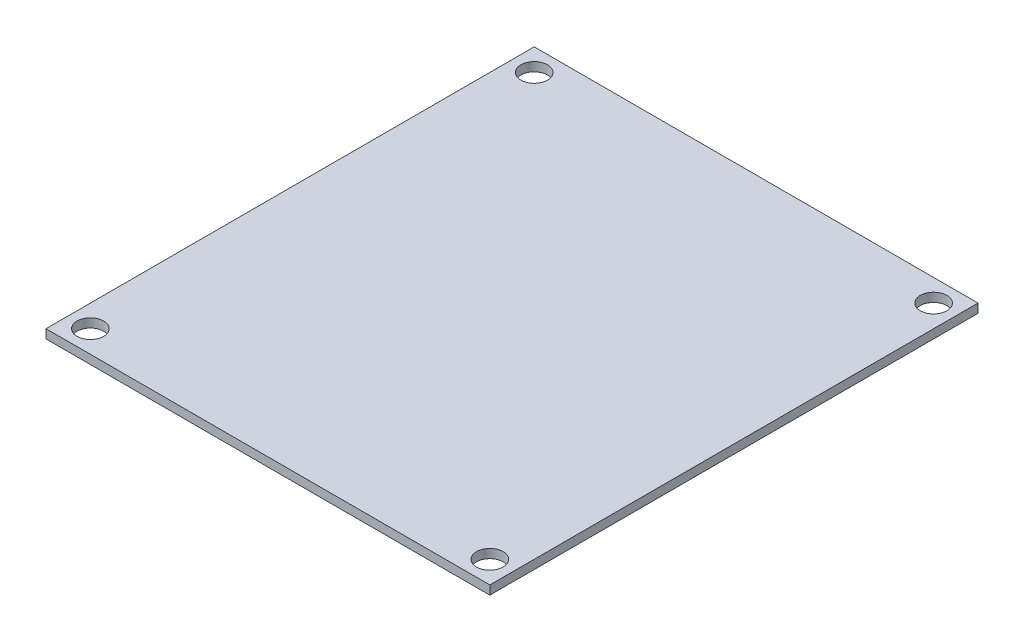
ISO-10303-21;
HEADER;
FILE_DESCRIPTION(('STEP AP214'),'2;1');
FILE_NAME('part.step','',(''),(''),'','','');
FILE_SCHEMA(('AUTOMOTIVE_DESIGN { 1 0 10303 214 1 1 1 1 }'));
ENDSEC;
DATA;
#1=APPLICATION_CONTEXT('core data for automotive mechanical design processes');
#2=APPLICATION_PROTOCOL_DEFINITION('international standard','automotive_design',2000,#1);
#3=PRODUCT_CONTEXT('',#1,'mechanical');
#4=PRODUCT('Part','Part','',(#3));
#5=PRODUCT_RELATED_PRODUCT_CATEGORY('part','',(#4));
#6=PRODUCT_DEFINITION_FORMATION('','',#4);
#7=PRODUCT_DEFINITION_CONTEXT('part definition',#1,'design');
#8=PRODUCT_DEFINITION('design','',#6,#7);
#9=PRODUCT_DEFINITION_SHAPE('','',#8);
#10=(LENGTH_UNIT() NAMED_UNIT(*) SI_UNIT(.MILLI.,.METRE.));
#11=(NAMED_UNIT(*) PLANE_ANGLE_UNIT() SI_UNIT($,.RADIAN.));
#12=(NAMED_UNIT(*) SI_UNIT($,.STERADIAN.) SOLID_ANGLE_UNIT());
#13=UNCERTAINTY_MEASURE_WITH_UNIT(LENGTH_MEASURE(1.E-05),#10,'distance_accuracy_value','');
#14=(GEOMETRIC_REPRESENTATION_CONTEXT(3) GLOBAL_UNCERTAINTY_ASSIGNED_CONTEXT((#13)) GLOBAL_UNIT_ASSIGNED_CONTEXT((#10,
#11,#12)) REPRESENTATION_CONTEXT('',''));
#15=CARTESIAN_POINT('',(0.,0.,0.));
#16=DIRECTION('',(0.,0.,1.));
#17=DIRECTION('',(1.,0.,0.));
#18=AXIS2_PLACEMENT_3D('',#15,#16,#17);
#19=CARTESIAN_POINT('',(0.,1.,0.));
#20=DIRECTION('',(1.,0.,0.));
#21=DIRECTION('',(0.,0.,-1.));
#22=AXIS2_PLACEMENT_3D('',#19,#20,#21);
#23=PLANE('',#22);
#24=DIRECTION('',(0.,0.,1.));
#25=VECTOR('',#24,1.);
#26=CARTESIAN_POINT('',(0.,0.,0.));
#27=LINE('',#26,#25);
#28=CARTESIAN_POINT('',(0.,0.,0.));
#29=VERTEX_POINT('',#28);
#30=CARTESIAN_POINT('',(0.,0.,55.));
#31=VERTEX_POINT('',#30);
#32=EDGE_CURVE('E101',#29,#31,#27,.T.);
#33=ORIENTED_EDGE('',*,*,#32,.T.);
#34=DIRECTION('',(0.,-1.,0.));
#35=VECTOR('',#34,1.);
#36=CARTESIAN_POINT('',(0.,1.,55.));
#37=LINE('',#36,#35);
#38=CARTESIAN_POINT('',(0.,1.,55.));
#39=VERTEX_POINT('',#38);
#40=EDGE_CURVE('E11',#39,#31,#37,.T.);
#41=ORIENTED_EDGE('',*,*,#40,.F.);
#42=DIRECTION('',(0.,0.,1.));
#43=VECTOR('',#42,1.);
#44=CARTESIAN_POINT('',(0.,1.,0.));
#45=LINE('',#44,#43);
#46=CARTESIAN_POINT('',(0.,1.,0.));
#47=VERTEX_POINT('',#46);
#48=EDGE_CURVE('E89',#47,#39,#45,.T.);
#49=ORIENTED_EDGE('',*,*,#48,.F.);
#50=DIRECTION('',(0.,-1.,0.));
#51=VECTOR('',#50,1.);
#52=CARTESIAN_POINT('',(0.,1.,0.));
#53=LINE('',#52,#51);
#54=EDGE_CURVE('E97',#47,#29,#53,.T.);
#55=ORIENTED_EDGE('',*,*,#54,.T.);
#56=EDGE_LOOP('',(#33,#41,#49,#55));
#57=FACE_BOUND('',#56,.T.);
#58=ADVANCED_FACE('F38',(#57),#23,.F.);
#59=CARTESIAN_POINT('',(0.,1.,55.));
#60=DIRECTION('',(0.,0.,-1.));
#61=DIRECTION('',(-1.,0.,0.));
#62=AXIS2_PLACEMENT_3D('',#59,#60,#61);
#63=PLANE('',#62);
#64=DIRECTION('',(1.,0.,0.));
#65=VECTOR('',#64,1.);
#66=CARTESIAN_POINT('',(0.,0.,55.));
#67=LINE('',#66,#65);
#68=CARTESIAN_POINT('',(50.,0.,55.));
#69=VERTEX_POINT('',#68);
#70=EDGE_CURVE('E93',#31,#69,#67,.T.);
#71=ORIENTED_EDGE('',*,*,#70,.T.);
#72=DIRECTION('',(0.,-1.,0.));
#73=VECTOR('',#72,1.);
#74=CARTESIAN_POINT('',(50.,1.,55.));
#75=LINE('',#74,#73);
#76=CARTESIAN_POINT('',(50.,1.,55.));
#77=VERTEX_POINT('',#76);
#78=EDGE_CURVE('E46',#77,#69,#75,.T.);
#79=ORIENTED_EDGE('',*,*,#78,.F.);
#80=DIRECTION('',(1.,0.,0.));
#81=VECTOR('',#80,1.);
#82=CARTESIAN_POINT('',(0.,1.,55.));
#83=LINE('',#82,#81);
#84=EDGE_CURVE('E84',#39,#77,#83,.T.);
#85=ORIENTED_EDGE('',*,*,#84,.F.);
#86=ORIENTED_EDGE('',*,*,#40,.T.);
#87=EDGE_LOOP('',(#71,#79,#85,#86));
#88=FACE_BOUND('',#87,.T.);
#89=ADVANCED_FACE('F92',(#88),#63,.F.);
#90=CARTESIAN_POINT('',(50.,1.,0.));
#91=DIRECTION('',(-1.,0.,0.));
#92=DIRECTION('',(0.,0.,1.));
#93=AXIS2_PLACEMENT_3D('',#90,#91,#92);
#94=PLANE('',#93);
#95=DIRECTION('',(0.,0.,-1.));
#96=VECTOR('',#95,1.);
#97=CARTESIAN_POINT('',(50.,0.,0.));
#98=LINE('',#97,#96);
#99=CARTESIAN_POINT('',(50.,0.,0.));
#100=VERTEX_POINT('',#99);
#101=EDGE_CURVE('E71',#69,#100,#98,.T.);
#102=ORIENTED_EDGE('',*,*,#101,.T.);
#103=DIRECTION('',(0.,-1.,0.));
#104=VECTOR('',#103,1.);
#105=CARTESIAN_POINT('',(50.,1.,0.));
#106=LINE('',#105,#104);
#107=CARTESIAN_POINT('',(50.,1.,0.));
#108=VERTEX_POINT('',#107);
#109=EDGE_CURVE('E94',#108,#100,#106,.T.);
#110=ORIENTED_EDGE('',*,*,#109,.F.);
#111=DIRECTION('',(0.,0.,-1.));
#112=VECTOR('',#111,1.);
#113=CARTESIAN_POINT('',(50.,1.,0.));
#114=LINE('',#113,#112);
#115=EDGE_CURVE('E87',#77,#108,#114,.T.);
#116=ORIENTED_EDGE('',*,*,#115,.F.);
#117=ORIENTED_EDGE('',*,*,#78,.T.);
#118=EDGE_LOOP('',(#102,#110,#116,#117));
#119=FACE_BOUND('',#118,.T.);
#120=ADVANCED_FACE('F95',(#119),#94,.F.);
#121=CARTESIAN_POINT('',(0.,1.,0.));
#122=DIRECTION('',(0.,0.,1.));
#123=DIRECTION('',(1.,0.,0.));
#124=AXIS2_PLACEMENT_3D('',#121,#122,#123);
#125=PLANE('',#124);
#126=DIRECTION('',(-1.,0.,0.));
#127=VECTOR('',#126,1.);
#128=CARTESIAN_POINT('',(0.,0.,0.));
#129=LINE('',#128,#127);
#130=EDGE_CURVE('E77',#100,#29,#129,.T.);
#131=ORIENTED_EDGE('',*,*,#130,.T.);
#132=ORIENTED_EDGE('',*,*,#54,.F.);
#133=DIRECTION('',(-1.,0.,0.));
#134=VECTOR('',#133,1.);
#135=CARTESIAN_POINT('',(0.,1.,0.));
#136=LINE('',#135,#134);
#137=EDGE_CURVE('E54',#108,#47,#136,.T.);
#138=ORIENTED_EDGE('',*,*,#137,.F.);
#139=ORIENTED_EDGE('',*,*,#109,.T.);
#140=EDGE_LOOP('',(#131,#132,#138,#139));
#141=FACE_BOUND('',#140,.T.);
#142=ADVANCED_FACE('F109',(#141),#125,.F.);
#143=CARTESIAN_POINT('',(0.,1.,0.));
#144=DIRECTION('',(0.,1.,0.));
#145=DIRECTION('',(0.,0.,1.));
#146=AXIS2_PLACEMENT_3D('',#143,#144,#145);
#147=PLANE('',#146);
#148=CARTESIAN_POINT('',(2.5,1.,52.5));
#149=DIRECTION('',(0.,1.,0.));
#150=DIRECTION('',(0.,0.,-1.));
#151=AXIS2_PLACEMENT_3D('',#148,#149,#150);
#152=CIRCLE('',#151,1.5);
#153=CARTESIAN_POINT('',(2.5,1.,51.));
#154=VERTEX_POINT('',#153);
#155=EDGE_CURVE('E133',#154,#154,#152,.T.);
#156=ORIENTED_EDGE('',*,*,#155,.F.);
#157=EDGE_LOOP('',(#156));
#158=FACE_BOUND('',#157,.T.);
#159=CARTESIAN_POINT('',(47.5,1.,52.5));
#160=DIRECTION('',(0.,1.,0.));
#161=DIRECTION('',(0.,0.,1.));
#162=AXIS2_PLACEMENT_3D('',#159,#160,#161);
#163=CIRCLE('',#162,1.5);
#164=CARTESIAN_POINT('',(47.5,1.,54.));
#165=VERTEX_POINT('',#164);
#166=EDGE_CURVE('E127',#165,#165,#163,.T.);
#167=ORIENTED_EDGE('',*,*,#166,.F.);
#168=EDGE_LOOP('',(#167));
#169=FACE_BOUND('',#168,.T.);
#170=CARTESIAN_POINT('',(47.5,1.,2.49999999999999));
#171=DIRECTION('',(0.,1.,0.));
#172=DIRECTION('',(0.,0.,-1.));
#173=AXIS2_PLACEMENT_3D('',#170,#171,#172);
#174=CIRCLE('',#173,1.5);
#175=CARTESIAN_POINT('',(47.5,1.,0.99999999999999));
#176=VERTEX_POINT('',#175);
#177=EDGE_CURVE('E121',#176,#176,#174,.T.);
#178=ORIENTED_EDGE('',*,*,#177,.F.);
#179=EDGE_LOOP('',(#178));
#180=FACE_BOUND('',#179,.T.);
#181=CARTESIAN_POINT('',(2.5,1.,2.5));
#182=DIRECTION('',(0.,1.,0.));
#183=DIRECTION('',(0.,0.,1.));
#184=AXIS2_PLACEMENT_3D('',#181,#182,#183);
#185=CIRCLE('',#184,1.5);
#186=CARTESIAN_POINT('',(2.5,1.,4.));
#187=VERTEX_POINT('',#186);
#188=EDGE_CURVE('E115',#187,#187,#185,.T.);
#189=ORIENTED_EDGE('',*,*,#188,.F.);
#190=EDGE_LOOP('',(#189));
#191=FACE_BOUND('',#190,.T.);
#192=ORIENTED_EDGE('',*,*,#48,.T.);
#193=ORIENTED_EDGE('',*,*,#84,.T.);
#194=ORIENTED_EDGE('',*,*,#115,.T.);
#195=ORIENTED_EDGE('',*,*,#137,.T.);
#196=EDGE_LOOP('',(#192,#193,#194,#195));
#197=FACE_BOUND('',#196,.T.);
#198=ADVANCED_FACE('F85',(#158,#169,#180,#191,#197),#147,.T.);
#199=CARTESIAN_POINT('',(0.,0.,0.));
#200=DIRECTION('',(0.,1.,0.));
#201=DIRECTION('',(0.,0.,1.));
#202=AXIS2_PLACEMENT_3D('',#199,#200,#201);
#203=PLANE('',#202);
#204=CARTESIAN_POINT('',(2.5,0.,52.5));
#205=DIRECTION('',(0.,1.,0.));
#206=DIRECTION('',(0.,0.,-1.));
#207=AXIS2_PLACEMENT_3D('',#204,#205,#206);
#208=CIRCLE('',#207,1.5);
#209=CARTESIAN_POINT('',(2.5,0.,51.));
#210=VERTEX_POINT('',#209);
#211=EDGE_CURVE('E130',#210,#210,#208,.T.);
#212=ORIENTED_EDGE('',*,*,#211,.T.);
#213=EDGE_LOOP('',(#212));
#214=FACE_BOUND('',#213,.T.);
#215=CARTESIAN_POINT('',(47.5,0.,52.5));
#216=DIRECTION('',(0.,1.,0.));
#217=DIRECTION('',(0.,0.,1.));
#218=AXIS2_PLACEMENT_3D('',#215,#216,#217);
#219=CIRCLE('',#218,1.5);
#220=CARTESIAN_POINT('',(47.5,0.,54.));
#221=VERTEX_POINT('',#220);
#222=EDGE_CURVE('E124',#221,#221,#219,.T.);
#223=ORIENTED_EDGE('',*,*,#222,.T.);
#224=EDGE_LOOP('',(#223));
#225=FACE_BOUND('',#224,.T.);
#226=CARTESIAN_POINT('',(47.5,0.,2.49999999999999));
#227=DIRECTION('',(0.,1.,0.));
#228=DIRECTION('',(0.,0.,-1.));
#229=AXIS2_PLACEMENT_3D('',#226,#227,#228);
#230=CIRCLE('',#229,1.5);
#231=CARTESIAN_POINT('',(47.5,0.,0.99999999999999));
#232=VERTEX_POINT('',#231);
#233=EDGE_CURVE('E118',#232,#232,#230,.T.);
#234=ORIENTED_EDGE('',*,*,#233,.T.);
#235=EDGE_LOOP('',(#234));
#236=FACE_BOUND('',#235,.T.);
#237=CARTESIAN_POINT('',(2.5,0.,2.5));
#238=DIRECTION('',(0.,1.,0.));
#239=DIRECTION('',(0.,0.,1.));
#240=AXIS2_PLACEMENT_3D('',#237,#238,#239);
#241=CIRCLE('',#240,1.5);
#242=CARTESIAN_POINT('',(2.5,0.,4.));
#243=VERTEX_POINT('',#242);
#244=EDGE_CURVE('E104',#243,#243,#241,.T.);
#245=ORIENTED_EDGE('',*,*,#244,.T.);
#246=EDGE_LOOP('',(#245));
#247=FACE_BOUND('',#246,.T.);
#248=ORIENTED_EDGE('',*,*,#32,.F.);
#249=ORIENTED_EDGE('',*,*,#130,.F.);
#250=ORIENTED_EDGE('',*,*,#101,.F.);
#251=ORIENTED_EDGE('',*,*,#70,.F.);
#252=EDGE_LOOP('',(#248,#249,#250,#251));
#253=FACE_BOUND('',#252,.T.);
#254=ADVANCED_FACE('F112',(#214,#225,#236,#247,#253),#203,.F.);
#255=CARTESIAN_POINT('',(2.5,0.,2.5));
#256=DIRECTION('',(0.,1.,0.));
#257=DIRECTION('',(0.,0.,1.));
#258=AXIS2_PLACEMENT_3D('',#255,#256,#257);
#259=CYLINDRICAL_SURFACE('',#258,1.5);
#260=ORIENTED_EDGE('',*,*,#244,.F.);
#261=EDGE_LOOP('',(#260));
#262=FACE_BOUND('',#261,.T.);
#263=ORIENTED_EDGE('',*,*,#188,.T.);
#264=EDGE_LOOP('',(#263));
#265=FACE_BOUND('',#264,.T.);
#266=ADVANCED_FACE('F157',(#262,#265),#259,.F.);
#267=CARTESIAN_POINT('',(47.5,0.,2.49999999999999));
#268=DIRECTION('',(0.,1.,0.));
#269=DIRECTION('',(0.,0.,1.));
#270=AXIS2_PLACEMENT_3D('',#267,#268,#269);
#271=CYLINDRICAL_SURFACE('',#270,1.5);
#272=ORIENTED_EDGE('',*,*,#233,.F.);
#273=EDGE_LOOP('',(#272));
#274=FACE_BOUND('',#273,.T.);
#275=ORIENTED_EDGE('',*,*,#177,.T.);
#276=EDGE_LOOP('',(#275));
#277=FACE_BOUND('',#276,.T.);
#278=ADVANCED_FACE('F159',(#274,#277),#271,.F.);
#279=CARTESIAN_POINT('',(47.5,0.,52.5));
#280=DIRECTION('',(0.,1.,0.));
#281=DIRECTION('',(0.,0.,1.));
#282=AXIS2_PLACEMENT_3D('',#279,#280,#281);
#283=CYLINDRICAL_SURFACE('',#282,1.5);
#284=ORIENTED_EDGE('',*,*,#222,.F.);
#285=EDGE_LOOP('',(#284));
#286=FACE_BOUND('',#285,.T.);
#287=ORIENTED_EDGE('',*,*,#166,.T.);
#288=EDGE_LOOP('',(#287));
#289=FACE_BOUND('',#288,.T.);
#290=ADVANCED_FACE('F144',(#286,#289),#283,.F.);
#291=CARTESIAN_POINT('',(2.5,0.,52.5));
#292=DIRECTION('',(0.,1.,0.));
#293=DIRECTION('',(0.,0.,1.));
#294=AXIS2_PLACEMENT_3D('',#291,#292,#293);
#295=CYLINDRICAL_SURFACE('',#294,1.5);
#296=ORIENTED_EDGE('',*,*,#211,.F.);
#297=EDGE_LOOP('',(#296));
#298=FACE_BOUND('',#297,.T.);
#299=ORIENTED_EDGE('',*,*,#155,.T.);
#300=EDGE_LOOP('',(#299));
#301=FACE_BOUND('',#300,.T.);
#302=ADVANCED_FACE('F141',(#298,#301),#295,.F.);
#303=CLOSED_SHELL('',(#58,#89,#120,#142,#198,#254,#266,#278,#290,#302));
#304=MANIFOLD_SOLID_BREP('B2',#303);
#305=ADVANCED_BREP_SHAPE_REPRESENTATION('',(#18,#304),#14);
#306=SHAPE_DEFINITION_REPRESENTATION(#9,#305);
ENDSEC;
END-ISO-10303-21;
